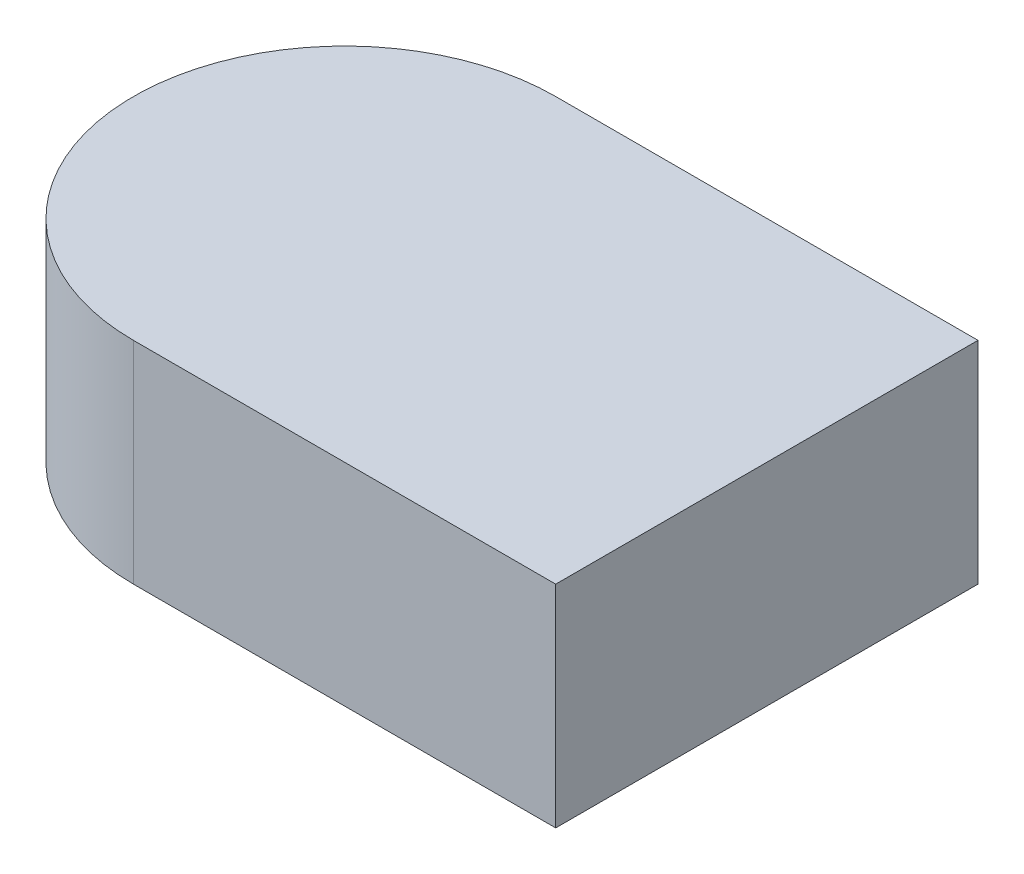
ISO-10303-21;
HEADER;
FILE_DESCRIPTION(('STEP AP214'),'2;1');
FILE_NAME('part.step','',(''),(''),'','','');
FILE_SCHEMA(('AUTOMOTIVE_DESIGN { 1 0 10303 214 1 1 1 1 }'));
ENDSEC;
DATA;
#1=APPLICATION_CONTEXT('core data for automotive mechanical design processes');
#2=APPLICATION_PROTOCOL_DEFINITION('international standard','automotive_design',2000,#1);
#3=PRODUCT_CONTEXT('',#1,'mechanical');
#4=PRODUCT('Part','Part','',(#3));
#5=PRODUCT_RELATED_PRODUCT_CATEGORY('part','',(#4));
#6=PRODUCT_DEFINITION_FORMATION('','',#4);
#7=PRODUCT_DEFINITION_CONTEXT('part definition',#1,'design');
#8=PRODUCT_DEFINITION('design','',#6,#7);
#9=PRODUCT_DEFINITION_SHAPE('','',#8);
#10=(LENGTH_UNIT() NAMED_UNIT(*) SI_UNIT(.MILLI.,.METRE.));
#11=(NAMED_UNIT(*) PLANE_ANGLE_UNIT() SI_UNIT($,.RADIAN.));
#12=(NAMED_UNIT(*) SI_UNIT($,.STERADIAN.) SOLID_ANGLE_UNIT());
#13=UNCERTAINTY_MEASURE_WITH_UNIT(LENGTH_MEASURE(1.E-05),#10,'distance_accuracy_value','');
#14=(GEOMETRIC_REPRESENTATION_CONTEXT(3) GLOBAL_UNCERTAINTY_ASSIGNED_CONTEXT((#13)) GLOBAL_UNIT_ASSIGNED_CONTEXT((#10,
#11,#12)) REPRESENTATION_CONTEXT('',''));
#15=CARTESIAN_POINT('',(0.,0.,0.));
#16=DIRECTION('',(0.,0.,1.));
#17=DIRECTION('',(1.,0.,0.));
#18=AXIS2_PLACEMENT_3D('',#15,#16,#17);
#19=CARTESIAN_POINT('',(0.,0.,0.));
#20=DIRECTION('',(0.,1.,0.));
#21=DIRECTION('',(1.,0.,0.));
#22=AXIS2_PLACEMENT_3D('',#19,#20,#21);
#23=PLANE('',#22);
#24=DIRECTION('',(0.,0.,-1.));
#25=VECTOR('',#24,1.);
#26=CARTESIAN_POINT('',(1.25,0.,-0.9));
#27=LINE('',#26,#25);
#28=CARTESIAN_POINT('',(1.25,0.,-0.9));
#29=VERTEX_POINT('',#28);
#30=CARTESIAN_POINT('',(1.25,0.,-1.1));
#31=VERTEX_POINT('',#30);
#32=EDGE_CURVE('E11',#29,#31,#27,.T.);
#33=ORIENTED_EDGE('',*,*,#32,.F.);
#34=DIRECTION('',(1.,0.,0.));
#35=VECTOR('',#34,1.);
#36=CARTESIAN_POINT('',(1.05,0.,-0.9));
#37=LINE('',#36,#35);
#38=CARTESIAN_POINT('',(1.05,0.,-0.9));
#39=VERTEX_POINT('',#38);
#40=EDGE_CURVE('E25',#39,#29,#37,.T.);
#41=ORIENTED_EDGE('',*,*,#40,.F.);
#42=CARTESIAN_POINT('',(1.05,0.,-1.));
#43=DIRECTION('',(0.,1.,0.));
#44=DIRECTION('',(0.,0.,-1.));
#45=AXIS2_PLACEMENT_3D('',#42,#43,#44);
#46=CIRCLE('',#45,0.1);
#47=CARTESIAN_POINT('',(1.05,0.,-1.1));
#48=VERTEX_POINT('',#47);
#49=EDGE_CURVE('E73',#48,#39,#46,.T.);
#50=ORIENTED_EDGE('',*,*,#49,.F.);
#51=DIRECTION('',(-1.,0.,0.));
#52=VECTOR('',#51,1.);
#53=CARTESIAN_POINT('',(1.25,0.,-1.1));
#54=LINE('',#53,#52);
#55=EDGE_CURVE('E99',#31,#48,#54,.T.);
#56=ORIENTED_EDGE('',*,*,#55,.F.);
#57=EDGE_LOOP('',(#33,#41,#50,#56));
#58=FACE_BOUND('',#57,.T.);
#59=ADVANCED_FACE('F17',(#58),#23,.F.);
#60=CARTESIAN_POINT('',(1.25,0.,-1.1));
#61=DIRECTION('',(0.,0.,-1.));
#62=DIRECTION('',(-1.,0.,0.));
#63=AXIS2_PLACEMENT_3D('',#60,#61,#62);
#64=PLANE('',#63);
#65=DIRECTION('',(0.,1.,0.));
#66=VECTOR('',#65,1.);
#67=CARTESIAN_POINT('',(1.05,0.,-1.1));
#68=LINE('',#67,#66);
#69=CARTESIAN_POINT('',(1.05,0.1,-1.1));
#70=VERTEX_POINT('',#69);
#71=EDGE_CURVE('E95',#48,#70,#68,.T.);
#72=ORIENTED_EDGE('',*,*,#71,.T.);
#73=DIRECTION('',(-1.,0.,0.));
#74=VECTOR('',#73,1.);
#75=CARTESIAN_POINT('',(1.25,0.1,-1.1));
#76=LINE('',#75,#74);
#77=CARTESIAN_POINT('',(1.25,0.1,-1.1));
#78=VERTEX_POINT('',#77);
#79=EDGE_CURVE('E68',#78,#70,#76,.T.);
#80=ORIENTED_EDGE('',*,*,#79,.F.);
#81=DIRECTION('',(0.,1.,0.));
#82=VECTOR('',#81,1.);
#83=CARTESIAN_POINT('',(1.25,0.,-1.1));
#84=LINE('',#83,#82);
#85=EDGE_CURVE('E87',#31,#78,#84,.T.);
#86=ORIENTED_EDGE('',*,*,#85,.F.);
#87=ORIENTED_EDGE('',*,*,#55,.T.);
#88=EDGE_LOOP('',(#72,#80,#86,#87));
#89=FACE_BOUND('',#88,.T.);
#90=ADVANCED_FACE('F113',(#89),#64,.T.);
#91=CARTESIAN_POINT('',(1.25,0.,-0.9));
#92=DIRECTION('',(1.,0.,0.));
#93=DIRECTION('',(0.,0.,-1.));
#94=AXIS2_PLACEMENT_3D('',#91,#92,#93);
#95=PLANE('',#94);
#96=ORIENTED_EDGE('',*,*,#85,.T.);
#97=DIRECTION('',(0.,0.,-1.));
#98=VECTOR('',#97,1.);
#99=CARTESIAN_POINT('',(1.25,0.1,-0.9));
#100=LINE('',#99,#98);
#101=CARTESIAN_POINT('',(1.25,0.1,-0.9));
#102=VERTEX_POINT('',#101);
#103=EDGE_CURVE('E83',#102,#78,#100,.T.);
#104=ORIENTED_EDGE('',*,*,#103,.F.);
#105=DIRECTION('',(0.,1.,0.));
#106=VECTOR('',#105,1.);
#107=CARTESIAN_POINT('',(1.25,0.,-0.9));
#108=LINE('',#107,#106);
#109=EDGE_CURVE('E60',#29,#102,#108,.T.);
#110=ORIENTED_EDGE('',*,*,#109,.F.);
#111=ORIENTED_EDGE('',*,*,#32,.T.);
#112=EDGE_LOOP('',(#96,#104,#110,#111));
#113=FACE_BOUND('',#112,.T.);
#114=ADVANCED_FACE('F119',(#113),#95,.T.);
#115=CARTESIAN_POINT('',(1.05,0.,-0.9));
#116=DIRECTION('',(0.,0.,1.));
#117=DIRECTION('',(1.,0.,0.));
#118=AXIS2_PLACEMENT_3D('',#115,#116,#117);
#119=PLANE('',#118);
#120=ORIENTED_EDGE('',*,*,#109,.T.);
#121=DIRECTION('',(1.,0.,0.));
#122=VECTOR('',#121,1.);
#123=CARTESIAN_POINT('',(1.05,0.1,-0.9));
#124=LINE('',#123,#122);
#125=CARTESIAN_POINT('',(1.05,0.1,-0.9));
#126=VERTEX_POINT('',#125);
#127=EDGE_CURVE('E54',#126,#102,#124,.T.);
#128=ORIENTED_EDGE('',*,*,#127,.F.);
#129=DIRECTION('',(0.,1.,0.));
#130=VECTOR('',#129,1.);
#131=CARTESIAN_POINT('',(1.05,0.,-0.9));
#132=LINE('',#131,#130);
#133=EDGE_CURVE('E58',#39,#126,#132,.T.);
#134=ORIENTED_EDGE('',*,*,#133,.F.);
#135=ORIENTED_EDGE('',*,*,#40,.T.);
#136=EDGE_LOOP('',(#120,#128,#134,#135));
#137=FACE_BOUND('',#136,.T.);
#138=ADVANCED_FACE('F56',(#137),#119,.T.);
#139=CARTESIAN_POINT('',(1.05,0.,-1.));
#140=DIRECTION('',(0.,1.,0.));
#141=DIRECTION('',(1.,0.,0.));
#142=AXIS2_PLACEMENT_3D('',#139,#140,#141);
#143=CYLINDRICAL_SURFACE('',#142,0.1);
#144=ORIENTED_EDGE('',*,*,#133,.T.);
#145=CARTESIAN_POINT('',(1.05,0.1,-1.));
#146=DIRECTION('',(0.,1.,0.));
#147=DIRECTION('',(0.,0.,-1.));
#148=AXIS2_PLACEMENT_3D('',#145,#146,#147);
#149=CIRCLE('',#148,0.1);
#150=EDGE_CURVE('E66',#70,#126,#149,.T.);
#151=ORIENTED_EDGE('',*,*,#150,.F.);
#152=ORIENTED_EDGE('',*,*,#71,.F.);
#153=ORIENTED_EDGE('',*,*,#49,.T.);
#154=EDGE_LOOP('',(#144,#151,#152,#153));
#155=FACE_BOUND('',#154,.T.);
#156=ADVANCED_FACE('F72',(#155),#143,.T.);
#157=CARTESIAN_POINT('',(0.,0.1,0.));
#158=DIRECTION('',(0.,1.,0.));
#159=DIRECTION('',(1.,0.,0.));
#160=AXIS2_PLACEMENT_3D('',#157,#158,#159);
#161=PLANE('',#160);
#162=ORIENTED_EDGE('',*,*,#150,.T.);
#163=ORIENTED_EDGE('',*,*,#127,.T.);
#164=ORIENTED_EDGE('',*,*,#103,.T.);
#165=ORIENTED_EDGE('',*,*,#79,.T.);
#166=EDGE_LOOP('',(#162,#163,#164,#165));
#167=FACE_BOUND('',#166,.T.);
#168=ADVANCED_FACE('F67',(#167),#161,.T.);
#169=CLOSED_SHELL('',(#59,#90,#114,#138,#156,#168));
#170=MANIFOLD_SOLID_BREP('B1',#169);
#171=ADVANCED_BREP_SHAPE_REPRESENTATION('',(#18,#170),#14);
#172=SHAPE_DEFINITION_REPRESENTATION(#9,#171);
ENDSEC;
END-ISO-10303-21;
